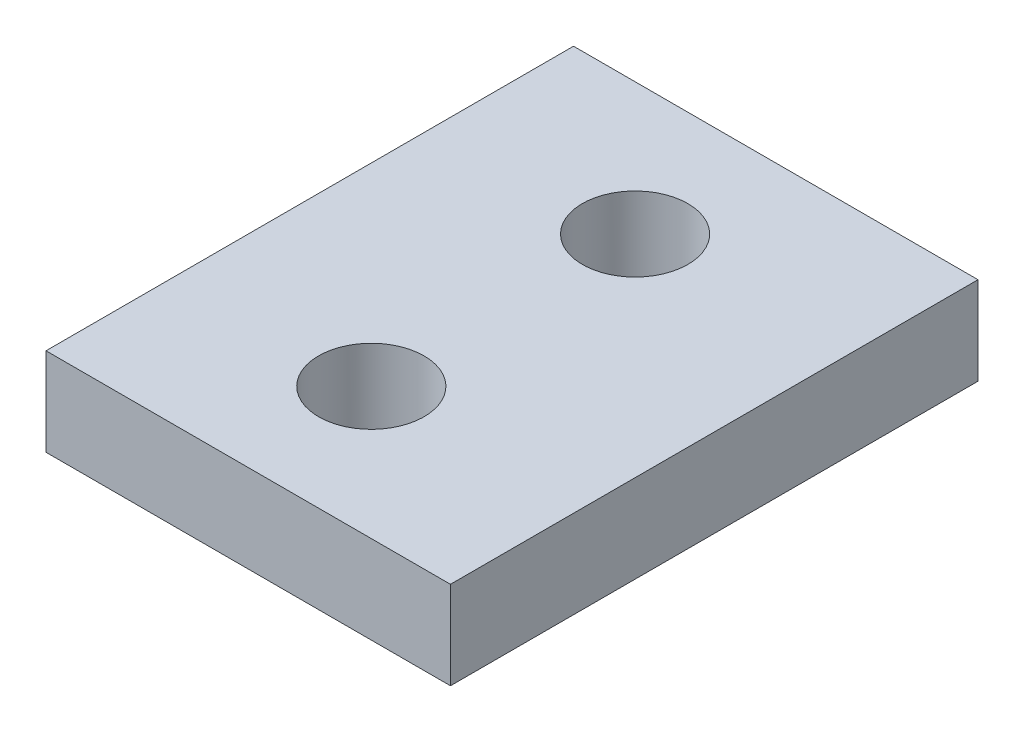
ISO-10303-21;
HEADER;
FILE_DESCRIPTION(('STEP AP214'),'2;1');
FILE_NAME('part.step','',(''),(''),'','','');
FILE_SCHEMA(('AUTOMOTIVE_DESIGN { 1 0 10303 214 1 1 1 1 }'));
ENDSEC;
DATA;
#1=APPLICATION_CONTEXT('core data for automotive mechanical design processes');
#2=APPLICATION_PROTOCOL_DEFINITION('international standard','automotive_design',2000,#1);
#3=PRODUCT_CONTEXT('',#1,'mechanical');
#4=PRODUCT('Part','Part','',(#3));
#5=PRODUCT_RELATED_PRODUCT_CATEGORY('part','',(#4));
#6=PRODUCT_DEFINITION_FORMATION('','',#4);
#7=PRODUCT_DEFINITION_CONTEXT('part definition',#1,'design');
#8=PRODUCT_DEFINITION('design','',#6,#7);
#9=PRODUCT_DEFINITION_SHAPE('','',#8);
#10=(LENGTH_UNIT() NAMED_UNIT(*) SI_UNIT(.MILLI.,.METRE.));
#11=(NAMED_UNIT(*) PLANE_ANGLE_UNIT() SI_UNIT($,.RADIAN.));
#12=(NAMED_UNIT(*) SI_UNIT($,.STERADIAN.) SOLID_ANGLE_UNIT());
#13=UNCERTAINTY_MEASURE_WITH_UNIT(LENGTH_MEASURE(1.E-05),#10,'distance_accuracy_value','');
#14=(GEOMETRIC_REPRESENTATION_CONTEXT(3) GLOBAL_UNCERTAINTY_ASSIGNED_CONTEXT((#13)) GLOBAL_UNIT_ASSIGNED_CONTEXT((#10,
#11,#12)) REPRESENTATION_CONTEXT('',''));
#15=CARTESIAN_POINT('',(0.,0.,0.));
#16=DIRECTION('',(0.,0.,1.));
#17=DIRECTION('',(1.,0.,0.));
#18=AXIS2_PLACEMENT_3D('',#15,#16,#17);
#19=CARTESIAN_POINT('',(42.,16.,15.));
#20=DIRECTION('',(1.,0.,0.));
#21=DIRECTION('',(0.,0.,-1.));
#22=AXIS2_PLACEMENT_3D('',#19,#20,#21);
#23=PLANE('',#22);
#24=DIRECTION('',(0.,0.,-1.));
#25=VECTOR('',#24,1.);
#26=CARTESIAN_POINT('',(42.,16.,15.));
#27=LINE('',#26,#25);
#28=CARTESIAN_POINT('',(42.,16.,15.));
#29=VERTEX_POINT('',#28);
#30=CARTESIAN_POINT('',(42.,16.,-15.));
#31=VERTEX_POINT('',#30);
#32=EDGE_CURVE('E96',#29,#31,#27,.T.);
#33=ORIENTED_EDGE('',*,*,#32,.T.);
#34=DIRECTION('',(0.,-1.,0.));
#35=VECTOR('',#34,1.);
#36=CARTESIAN_POINT('',(42.,16.,-15.));
#37=LINE('',#36,#35);
#38=CARTESIAN_POINT('',(42.,11.,-15.));
#39=VERTEX_POINT('',#38);
#40=EDGE_CURVE('E91',#31,#39,#37,.T.);
#41=ORIENTED_EDGE('',*,*,#40,.T.);
#42=DIRECTION('',(0.,0.,-1.));
#43=VECTOR('',#42,1.);
#44=CARTESIAN_POINT('',(42.,11.,15.));
#45=LINE('',#44,#43);
#46=CARTESIAN_POINT('',(42.,11.,15.));
#47=VERTEX_POINT('',#46);
#48=EDGE_CURVE('E11',#47,#39,#45,.T.);
#49=ORIENTED_EDGE('',*,*,#48,.F.);
#50=DIRECTION('',(0.,-1.,0.));
#51=VECTOR('',#50,1.);
#52=CARTESIAN_POINT('',(42.,16.,15.));
#53=LINE('',#52,#51);
#54=EDGE_CURVE('E107',#29,#47,#53,.T.);
#55=ORIENTED_EDGE('',*,*,#54,.F.);
#56=EDGE_LOOP('',(#33,#41,#49,#55));
#57=FACE_BOUND('',#56,.T.);
#58=ADVANCED_FACE('F39',(#57),#23,.F.);
#59=CARTESIAN_POINT('',(42.,11.,15.));
#60=DIRECTION('',(0.,1.,0.));
#61=DIRECTION('',(0.,0.,1.));
#62=AXIS2_PLACEMENT_3D('',#59,#60,#61);
#63=PLANE('',#62);
#64=CARTESIAN_POINT('',(53.,11.,-7.5));
#65=DIRECTION('',(0.,1.,0.));
#66=DIRECTION('',(0.,0.,1.));
#67=AXIS2_PLACEMENT_3D('',#64,#65,#66);
#68=CIRCLE('',#67,3.);
#69=CARTESIAN_POINT('',(53.,11.,-4.5));
#70=VERTEX_POINT('',#69);
#71=EDGE_CURVE('E97',#70,#70,#68,.F.);
#72=ORIENTED_EDGE('',*,*,#71,.F.);
#73=EDGE_LOOP('',(#72));
#74=FACE_BOUND('',#73,.T.);
#75=CARTESIAN_POINT('',(53.,11.,7.5));
#76=DIRECTION('',(0.,1.,0.));
#77=DIRECTION('',(0.,0.,1.));
#78=AXIS2_PLACEMENT_3D('',#75,#76,#77);
#79=CIRCLE('',#78,3.);
#80=CARTESIAN_POINT('',(53.,11.,10.5));
#81=VERTEX_POINT('',#80);
#82=EDGE_CURVE('E100',#81,#81,#79,.F.);
#83=ORIENTED_EDGE('',*,*,#82,.F.);
#84=EDGE_LOOP('',(#83));
#85=FACE_BOUND('',#84,.T.);
#86=ORIENTED_EDGE('',*,*,#48,.T.);
#87=DIRECTION('',(1.,0.,0.));
#88=VECTOR('',#87,1.);
#89=CARTESIAN_POINT('',(42.,11.,-15.));
#90=LINE('',#89,#88);
#91=CARTESIAN_POINT('',(65.,11.,-15.));
#92=VERTEX_POINT('',#91);
#93=EDGE_CURVE('E81',#39,#92,#90,.T.);
#94=ORIENTED_EDGE('',*,*,#93,.T.);
#95=DIRECTION('',(0.,0.,-1.));
#96=VECTOR('',#95,1.);
#97=CARTESIAN_POINT('',(65.,11.,15.));
#98=LINE('',#97,#96);
#99=CARTESIAN_POINT('',(65.,11.,15.));
#100=VERTEX_POINT('',#99);
#101=EDGE_CURVE('E46',#100,#92,#98,.T.);
#102=ORIENTED_EDGE('',*,*,#101,.F.);
#103=DIRECTION('',(1.,0.,0.));
#104=VECTOR('',#103,1.);
#105=CARTESIAN_POINT('',(42.,11.,15.));
#106=LINE('',#105,#104);
#107=EDGE_CURVE('E82',#47,#100,#106,.T.);
#108=ORIENTED_EDGE('',*,*,#107,.F.);
#109=EDGE_LOOP('',(#86,#94,#102,#108));
#110=FACE_BOUND('',#109,.T.);
#111=ADVANCED_FACE('F79',(#74,#85,#110),#63,.F.);
#112=CARTESIAN_POINT('',(65.,16.,15.));
#113=DIRECTION('',(-1.,0.,0.));
#114=DIRECTION('',(0.,0.,1.));
#115=AXIS2_PLACEMENT_3D('',#112,#113,#114);
#116=PLANE('',#115);
#117=ORIENTED_EDGE('',*,*,#101,.T.);
#118=DIRECTION('',(0.,1.,0.));
#119=VECTOR('',#118,1.);
#120=CARTESIAN_POINT('',(65.,16.,-15.));
#121=LINE('',#120,#119);
#122=CARTESIAN_POINT('',(65.,16.,-15.));
#123=VERTEX_POINT('',#122);
#124=EDGE_CURVE('E94',#92,#123,#121,.T.);
#125=ORIENTED_EDGE('',*,*,#124,.T.);
#126=DIRECTION('',(0.,0.,-1.));
#127=VECTOR('',#126,1.);
#128=CARTESIAN_POINT('',(65.,16.,15.));
#129=LINE('',#128,#127);
#130=CARTESIAN_POINT('',(65.,16.,15.));
#131=VERTEX_POINT('',#130);
#132=EDGE_CURVE('E113',#131,#123,#129,.T.);
#133=ORIENTED_EDGE('',*,*,#132,.F.);
#134=DIRECTION('',(0.,1.,0.));
#135=VECTOR('',#134,1.);
#136=CARTESIAN_POINT('',(65.,16.,15.));
#137=LINE('',#136,#135);
#138=EDGE_CURVE('E58',#100,#131,#137,.T.);
#139=ORIENTED_EDGE('',*,*,#138,.F.);
#140=EDGE_LOOP('',(#117,#125,#133,#139));
#141=FACE_BOUND('',#140,.T.);
#142=ADVANCED_FACE('F115',(#141),#116,.F.);
#143=CARTESIAN_POINT('',(42.,16.,15.));
#144=DIRECTION('',(0.,-1.,0.));
#145=DIRECTION('',(0.,0.,-1.));
#146=AXIS2_PLACEMENT_3D('',#143,#144,#145);
#147=PLANE('',#146);
#148=CARTESIAN_POINT('',(53.,16.,-7.5));
#149=DIRECTION('',(0.,-1.,0.));
#150=DIRECTION('',(0.,0.,-1.));
#151=AXIS2_PLACEMENT_3D('',#148,#149,#150);
#152=CIRCLE('',#151,3.);
#153=CARTESIAN_POINT('',(53.,16.,-10.5));
#154=VERTEX_POINT('',#153);
#155=EDGE_CURVE('E143',#154,#154,#152,.T.);
#156=ORIENTED_EDGE('',*,*,#155,.T.);
#157=EDGE_LOOP('',(#156));
#158=FACE_BOUND('',#157,.T.);
#159=CARTESIAN_POINT('',(53.,16.,7.5));
#160=DIRECTION('',(0.,-1.,0.));
#161=DIRECTION('',(0.,0.,-1.));
#162=AXIS2_PLACEMENT_3D('',#159,#160,#161);
#163=CIRCLE('',#162,3.);
#164=CARTESIAN_POINT('',(53.,16.,4.5));
#165=VERTEX_POINT('',#164);
#166=EDGE_CURVE('E145',#165,#165,#163,.T.);
#167=ORIENTED_EDGE('',*,*,#166,.T.);
#168=EDGE_LOOP('',(#167));
#169=FACE_BOUND('',#168,.T.);
#170=ORIENTED_EDGE('',*,*,#132,.T.);
#171=DIRECTION('',(-1.,0.,0.));
#172=VECTOR('',#171,1.);
#173=CARTESIAN_POINT('',(42.,16.,-15.));
#174=LINE('',#173,#172);
#175=EDGE_CURVE('E105',#123,#31,#174,.T.);
#176=ORIENTED_EDGE('',*,*,#175,.T.);
#177=ORIENTED_EDGE('',*,*,#32,.F.);
#178=DIRECTION('',(-1.,0.,0.));
#179=VECTOR('',#178,1.);
#180=CARTESIAN_POINT('',(42.,16.,15.));
#181=LINE('',#180,#179);
#182=EDGE_CURVE('E53',#131,#29,#181,.T.);
#183=ORIENTED_EDGE('',*,*,#182,.F.);
#184=EDGE_LOOP('',(#170,#176,#177,#183));
#185=FACE_BOUND('',#184,.T.);
#186=ADVANCED_FACE('F117',(#158,#169,#185),#147,.F.);
#187=CARTESIAN_POINT('',(0.,0.,15.));
#188=DIRECTION('',(0.,0.,1.));
#189=DIRECTION('',(1.,0.,0.));
#190=AXIS2_PLACEMENT_3D('',#187,#188,#189);
#191=PLANE('',#190);
#192=ORIENTED_EDGE('',*,*,#54,.T.);
#193=ORIENTED_EDGE('',*,*,#107,.T.);
#194=ORIENTED_EDGE('',*,*,#138,.T.);
#195=ORIENTED_EDGE('',*,*,#182,.T.);
#196=EDGE_LOOP('',(#192,#193,#194,#195));
#197=FACE_BOUND('',#196,.T.);
#198=ADVANCED_FACE('F118',(#197),#191,.T.);
#199=CARTESIAN_POINT('',(0.,0.,-15.));
#200=DIRECTION('',(0.,0.,1.));
#201=DIRECTION('',(1.,0.,0.));
#202=AXIS2_PLACEMENT_3D('',#199,#200,#201);
#203=PLANE('',#202);
#204=ORIENTED_EDGE('',*,*,#40,.F.);
#205=ORIENTED_EDGE('',*,*,#175,.F.);
#206=ORIENTED_EDGE('',*,*,#124,.F.);
#207=ORIENTED_EDGE('',*,*,#93,.F.);
#208=EDGE_LOOP('',(#204,#205,#206,#207));
#209=FACE_BOUND('',#208,.T.);
#210=ADVANCED_FACE('F89',(#209),#203,.F.);
#211=CARTESIAN_POINT('',(53.,24.4852813742386,7.5));
#212=DIRECTION('',(0.,-1.,0.));
#213=DIRECTION('',(0.,0.,-1.));
#214=AXIS2_PLACEMENT_3D('',#211,#212,#213);
#215=CYLINDRICAL_SURFACE('',#214,3.);
#216=ORIENTED_EDGE('',*,*,#166,.F.);
#217=EDGE_LOOP('',(#216));
#218=FACE_BOUND('',#217,.T.);
#219=ORIENTED_EDGE('',*,*,#82,.T.);
#220=EDGE_LOOP('',(#219));
#221=FACE_BOUND('',#220,.T.);
#222=ADVANCED_FACE('F125',(#218,#221),#215,.F.);
#223=CARTESIAN_POINT('',(53.,24.4852813742386,-7.5));
#224=DIRECTION('',(0.,-1.,0.));
#225=DIRECTION('',(0.,0.,-1.));
#226=AXIS2_PLACEMENT_3D('',#223,#224,#225);
#227=CYLINDRICAL_SURFACE('',#226,3.);
#228=ORIENTED_EDGE('',*,*,#155,.F.);
#229=EDGE_LOOP('',(#228));
#230=FACE_BOUND('',#229,.T.);
#231=ORIENTED_EDGE('',*,*,#71,.T.);
#232=EDGE_LOOP('',(#231));
#233=FACE_BOUND('',#232,.T.);
#234=ADVANCED_FACE('F153',(#230,#233),#227,.F.);
#235=CLOSED_SHELL('',(#58,#111,#142,#186,#198,#210,#222,#234));
#236=MANIFOLD_SOLID_BREP('B2',#235);
#237=ADVANCED_BREP_SHAPE_REPRESENTATION('',(#18,#236),#14);
#238=SHAPE_DEFINITION_REPRESENTATION(#9,#237);
ENDSEC;
END-ISO-10303-21;
